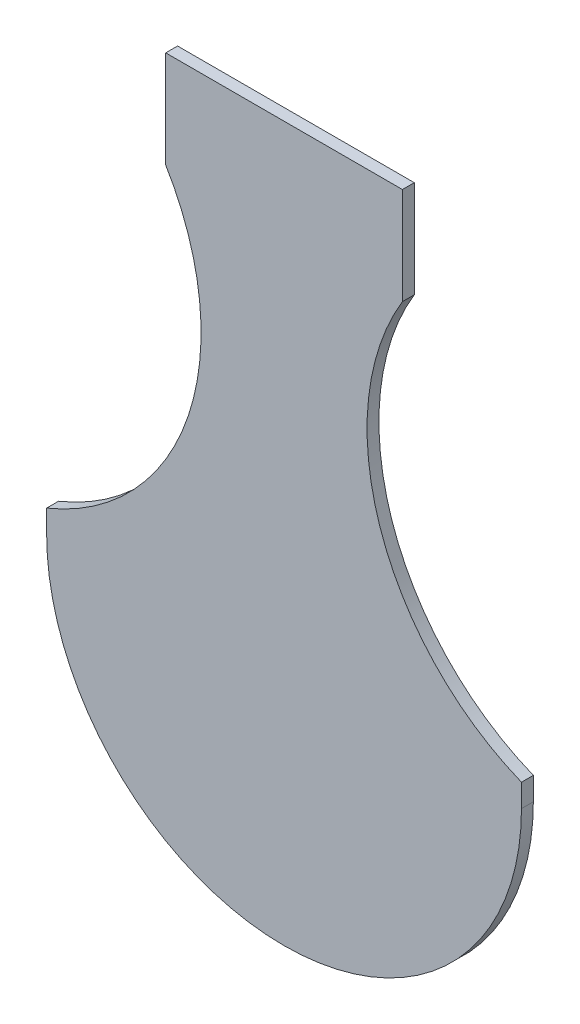
ISO-10303-21;
HEADER;
FILE_DESCRIPTION(('STEP AP214'),'2;1');
FILE_NAME('part.step','',(''),(''),'','','');
FILE_SCHEMA(('AUTOMOTIVE_DESIGN { 1 0 10303 214 1 1 1 1 }'));
ENDSEC;
DATA;
#1=APPLICATION_CONTEXT('core data for automotive mechanical design processes');
#2=APPLICATION_PROTOCOL_DEFINITION('international standard','automotive_design',2000,#1);
#3=PRODUCT_CONTEXT('',#1,'mechanical');
#4=PRODUCT('Part','Part','',(#3));
#5=PRODUCT_RELATED_PRODUCT_CATEGORY('part','',(#4));
#6=PRODUCT_DEFINITION_FORMATION('','',#4);
#7=PRODUCT_DEFINITION_CONTEXT('part definition',#1,'design');
#8=PRODUCT_DEFINITION('design','',#6,#7);
#9=PRODUCT_DEFINITION_SHAPE('','',#8);
#10=(LENGTH_UNIT() NAMED_UNIT(*) SI_UNIT(.MILLI.,.METRE.));
#11=(NAMED_UNIT(*) PLANE_ANGLE_UNIT() SI_UNIT($,.RADIAN.));
#12=(NAMED_UNIT(*) SI_UNIT($,.STERADIAN.) SOLID_ANGLE_UNIT());
#13=UNCERTAINTY_MEASURE_WITH_UNIT(LENGTH_MEASURE(1.E-05),#10,'distance_accuracy_value','');
#14=(GEOMETRIC_REPRESENTATION_CONTEXT(3) GLOBAL_UNCERTAINTY_ASSIGNED_CONTEXT((#13)) GLOBAL_UNIT_ASSIGNED_CONTEXT((#10,
#11,#12)) REPRESENTATION_CONTEXT('',''));
#15=CARTESIAN_POINT('',(0.,0.,0.));
#16=DIRECTION('',(0.,0.,1.));
#17=DIRECTION('',(1.,0.,0.));
#18=AXIS2_PLACEMENT_3D('',#15,#16,#17);
#19=CARTESIAN_POINT('',(-60.,65.7793965940956,3.));
#20=DIRECTION('',(1.,0.,0.));
#21=DIRECTION('',(0.,1.,0.));
#22=AXIS2_PLACEMENT_3D('',#19,#20,#21);
#23=PLANE('',#22);
#24=DIRECTION('',(0.,0.,1.));
#25=VECTOR('',#24,1.);
#26=CARTESIAN_POINT('',(-60.,60.,0.));
#27=LINE('',#26,#25);
#28=CARTESIAN_POINT('',(-60.,60.,0.));
#29=VERTEX_POINT('',#28);
#30=CARTESIAN_POINT('',(-60.,60.,3.));
#31=VERTEX_POINT('',#30);
#32=EDGE_CURVE('E163',#29,#31,#27,.T.);
#33=ORIENTED_EDGE('',*,*,#32,.T.);
#34=DIRECTION('',(0.,-1.,0.));
#35=VECTOR('',#34,1.);
#36=CARTESIAN_POINT('',(-60.,65.7793965940956,3.));
#37=LINE('',#36,#35);
#38=CARTESIAN_POINT('',(-60.,65.7793965940956,3.));
#39=VERTEX_POINT('',#38);
#40=EDGE_CURVE('E122',#39,#31,#37,.T.);
#41=ORIENTED_EDGE('',*,*,#40,.F.);
#42=DIRECTION('',(0.,0.,-1.));
#43=VECTOR('',#42,1.);
#44=CARTESIAN_POINT('',(-60.,65.7793965940956,3.));
#45=LINE('',#44,#43);
#46=CARTESIAN_POINT('',(-60.,65.7793965940956,0.));
#47=VERTEX_POINT('',#46);
#48=EDGE_CURVE('E118',#39,#47,#45,.T.);
#49=ORIENTED_EDGE('',*,*,#48,.T.);
#50=DIRECTION('',(0.,-1.,0.));
#51=VECTOR('',#50,1.);
#52=CARTESIAN_POINT('',(-60.,65.7793965940956,0.));
#53=LINE('',#52,#51);
#54=EDGE_CURVE('E139',#47,#29,#53,.T.);
#55=ORIENTED_EDGE('',*,*,#54,.T.);
#56=EDGE_LOOP('',(#33,#41,#49,#55));
#57=FACE_BOUND('',#56,.T.);
#58=ADVANCED_FACE('F33',(#57),#23,.F.);
#59=CARTESIAN_POINT('',(83.4736078855162,123.703827819936,3.));
#60=DIRECTION('',(0.,0.,-1.));
#61=DIRECTION('',(-1.,0.,0.));
#62=AXIS2_PLACEMENT_3D('',#59,#60,#61);
#63=CYLINDRICAL_SURFACE('',#62,62.5000000000003);
#64=CARTESIAN_POINT('',(83.4736078855162,123.703827819936,0.));
#65=DIRECTION('',(0.,0.,-1.));
#66=DIRECTION('',(-1.,0.,0.));
#67=AXIS2_PLACEMENT_3D('',#64,#65,#66);
#68=CIRCLE('',#67,62.5000000000003);
#69=CARTESIAN_POINT('',(60.,65.7793965940956,0.));
#70=VERTEX_POINT('',#69);
#71=CARTESIAN_POINT('',(29.909652168719,155.908682236142,0.));
#72=VERTEX_POINT('',#71);
#73=EDGE_CURVE('E129',#70,#72,#68,.T.);
#74=ORIENTED_EDGE('',*,*,#73,.T.);
#75=DIRECTION('',(0.,0.,-1.));
#76=VECTOR('',#75,1.);
#77=CARTESIAN_POINT('',(29.909652168719,155.908682236142,3.));
#78=LINE('',#77,#76);
#79=CARTESIAN_POINT('',(29.909652168719,155.908682236142,3.));
#80=VERTEX_POINT('',#79);
#81=EDGE_CURVE('E42',#80,#72,#78,.T.);
#82=ORIENTED_EDGE('',*,*,#81,.F.);
#83=CARTESIAN_POINT('',(83.4736078855162,123.703827819936,3.));
#84=DIRECTION('',(0.,0.,-1.));
#85=DIRECTION('',(-1.,0.,0.));
#86=AXIS2_PLACEMENT_3D('',#83,#84,#85);
#87=CIRCLE('',#86,62.5000000000003);
#88=CARTESIAN_POINT('',(60.,65.7793965940956,3.));
#89=VERTEX_POINT('',#88);
#90=EDGE_CURVE('E143',#89,#80,#87,.T.);
#91=ORIENTED_EDGE('',*,*,#90,.F.);
#92=DIRECTION('',(0.,0.,-1.));
#93=VECTOR('',#92,1.);
#94=CARTESIAN_POINT('',(60.,65.7793965940956,3.));
#95=LINE('',#94,#93);
#96=EDGE_CURVE('E128',#89,#70,#95,.T.);
#97=ORIENTED_EDGE('',*,*,#96,.T.);
#98=EDGE_LOOP('',(#74,#82,#91,#97));
#99=FACE_BOUND('',#98,.T.);
#100=ADVANCED_FACE('F35',(#99),#63,.F.);
#101=CARTESIAN_POINT('',(29.909652168719,155.908682236142,3.));
#102=DIRECTION('',(-1.,0.,0.));
#103=DIRECTION('',(0.,0.,1.));
#104=AXIS2_PLACEMENT_3D('',#101,#102,#103);
#105=PLANE('',#104);
#106=DIRECTION('',(0.,1.,0.));
#107=VECTOR('',#106,1.);
#108=CARTESIAN_POINT('',(29.909652168719,155.908682236142,0.));
#109=LINE('',#108,#107);
#110=CARTESIAN_POINT('',(29.909652168719,180.45552865264,0.));
#111=VERTEX_POINT('',#110);
#112=EDGE_CURVE('E132',#72,#111,#109,.T.);
#113=ORIENTED_EDGE('',*,*,#112,.T.);
#114=DIRECTION('',(0.,0.,-1.));
#115=VECTOR('',#114,1.);
#116=CARTESIAN_POINT('',(29.909652168719,180.45552865264,3.));
#117=LINE('',#116,#115);
#118=CARTESIAN_POINT('',(29.909652168719,180.45552865264,3.));
#119=VERTEX_POINT('',#118);
#120=EDGE_CURVE('E147',#119,#111,#117,.T.);
#121=ORIENTED_EDGE('',*,*,#120,.F.);
#122=DIRECTION('',(0.,1.,0.));
#123=VECTOR('',#122,1.);
#124=CARTESIAN_POINT('',(29.909652168719,155.908682236142,3.));
#125=LINE('',#124,#123);
#126=EDGE_CURVE('E91',#80,#119,#125,.T.);
#127=ORIENTED_EDGE('',*,*,#126,.F.);
#128=ORIENTED_EDGE('',*,*,#81,.T.);
#129=EDGE_LOOP('',(#113,#121,#127,#128));
#130=FACE_BOUND('',#129,.T.);
#131=ADVANCED_FACE('F150',(#130),#105,.F.);
#132=CARTESIAN_POINT('',(-29.909652168719,180.45552865264,3.));
#133=DIRECTION('',(0.,-1.,0.));
#134=DIRECTION('',(0.,0.,-1.));
#135=AXIS2_PLACEMENT_3D('',#132,#133,#134);
#136=PLANE('',#135);
#137=DIRECTION('',(-1.,0.,0.));
#138=VECTOR('',#137,1.);
#139=CARTESIAN_POINT('',(-29.909652168719,180.45552865264,0.));
#140=LINE('',#139,#138);
#141=CARTESIAN_POINT('',(-29.909652168719,180.45552865264,0.));
#142=VERTEX_POINT('',#141);
#143=EDGE_CURVE('E135',#111,#142,#140,.T.);
#144=ORIENTED_EDGE('',*,*,#143,.T.);
#145=DIRECTION('',(0.,0.,-1.));
#146=VECTOR('',#145,1.);
#147=CARTESIAN_POINT('',(-29.909652168719,180.45552865264,3.));
#148=LINE('',#147,#146);
#149=CARTESIAN_POINT('',(-29.909652168719,180.45552865264,3.));
#150=VERTEX_POINT('',#149);
#151=EDGE_CURVE('E117',#150,#142,#148,.T.);
#152=ORIENTED_EDGE('',*,*,#151,.F.);
#153=DIRECTION('',(-1.,0.,0.));
#154=VECTOR('',#153,1.);
#155=CARTESIAN_POINT('',(-29.909652168719,180.45552865264,3.));
#156=LINE('',#155,#154);
#157=EDGE_CURVE('E108',#119,#150,#156,.T.);
#158=ORIENTED_EDGE('',*,*,#157,.F.);
#159=ORIENTED_EDGE('',*,*,#120,.T.);
#160=EDGE_LOOP('',(#144,#152,#158,#159));
#161=FACE_BOUND('',#160,.T.);
#162=ADVANCED_FACE('F159',(#161),#136,.F.);
#163=CARTESIAN_POINT('',(-29.909652168719,155.908682236142,3.));
#164=DIRECTION('',(1.,0.,0.));
#165=DIRECTION('',(0.,0.,-1.));
#166=AXIS2_PLACEMENT_3D('',#163,#164,#165);
#167=PLANE('',#166);
#168=DIRECTION('',(0.,-1.,0.));
#169=VECTOR('',#168,1.);
#170=CARTESIAN_POINT('',(-29.909652168719,155.908682236142,0.));
#171=LINE('',#170,#169);
#172=CARTESIAN_POINT('',(-29.909652168719,155.908682236142,0.));
#173=VERTEX_POINT('',#172);
#174=EDGE_CURVE('E116',#142,#173,#171,.T.);
#175=ORIENTED_EDGE('',*,*,#174,.T.);
#176=DIRECTION('',(0.,0.,-1.));
#177=VECTOR('',#176,1.);
#178=CARTESIAN_POINT('',(-29.909652168719,155.908682236142,3.));
#179=LINE('',#178,#177);
#180=CARTESIAN_POINT('',(-29.909652168719,155.908682236142,3.));
#181=VERTEX_POINT('',#180);
#182=EDGE_CURVE('E113',#181,#173,#179,.T.);
#183=ORIENTED_EDGE('',*,*,#182,.F.);
#184=DIRECTION('',(0.,-1.,0.));
#185=VECTOR('',#184,1.);
#186=CARTESIAN_POINT('',(-29.909652168719,155.908682236142,3.));
#187=LINE('',#186,#185);
#188=EDGE_CURVE('E101',#150,#181,#187,.T.);
#189=ORIENTED_EDGE('',*,*,#188,.F.);
#190=ORIENTED_EDGE('',*,*,#151,.T.);
#191=EDGE_LOOP('',(#175,#183,#189,#190));
#192=FACE_BOUND('',#191,.T.);
#193=ADVANCED_FACE('F114',(#192),#167,.F.);
#194=CARTESIAN_POINT('',(-83.4736078855162,123.703827819936,3.));
#195=DIRECTION('',(0.,0.,-1.));
#196=DIRECTION('',(-1.,0.,0.));
#197=AXIS2_PLACEMENT_3D('',#194,#195,#196);
#198=CYLINDRICAL_SURFACE('',#197,62.5000000000003);
#199=CARTESIAN_POINT('',(-83.4736078855162,123.703827819936,0.));
#200=DIRECTION('',(0.,0.,-1.));
#201=DIRECTION('',(1.,0.,0.));
#202=AXIS2_PLACEMENT_3D('',#199,#200,#201);
#203=CIRCLE('',#202,62.5000000000003);
#204=EDGE_CURVE('E75',#173,#47,#203,.T.);
#205=ORIENTED_EDGE('',*,*,#204,.T.);
#206=ORIENTED_EDGE('',*,*,#48,.F.);
#207=CARTESIAN_POINT('',(-83.4736078855162,123.703827819936,3.));
#208=DIRECTION('',(0.,0.,-1.));
#209=DIRECTION('',(1.,0.,0.));
#210=AXIS2_PLACEMENT_3D('',#207,#208,#209);
#211=CIRCLE('',#210,62.5000000000003);
#212=EDGE_CURVE('E106',#181,#39,#211,.T.);
#213=ORIENTED_EDGE('',*,*,#212,.F.);
#214=ORIENTED_EDGE('',*,*,#182,.T.);
#215=EDGE_LOOP('',(#205,#206,#213,#214));
#216=FACE_BOUND('',#215,.T.);
#217=ADVANCED_FACE('F120',(#216),#198,.F.);
#218=CARTESIAN_POINT('',(60.,65.7793965940956,3.));
#219=DIRECTION('',(-1.,0.,0.));
#220=DIRECTION('',(0.,-1.,0.));
#221=AXIS2_PLACEMENT_3D('',#218,#219,#220);
#222=PLANE('',#221);
#223=DIRECTION('',(0.,1.,0.));
#224=VECTOR('',#223,1.);
#225=CARTESIAN_POINT('',(60.,65.7793965940956,3.));
#226=LINE('',#225,#224);
#227=CARTESIAN_POINT('',(60.,60.,3.));
#228=VERTEX_POINT('',#227);
#229=EDGE_CURVE('E50',#228,#89,#226,.T.);
#230=ORIENTED_EDGE('',*,*,#229,.F.);
#231=DIRECTION('',(0.,0.,1.));
#232=VECTOR('',#231,1.);
#233=CARTESIAN_POINT('',(60.,60.,0.));
#234=LINE('',#233,#232);
#235=CARTESIAN_POINT('',(60.,60.,0.));
#236=VERTEX_POINT('',#235);
#237=EDGE_CURVE('E133',#236,#228,#234,.T.);
#238=ORIENTED_EDGE('',*,*,#237,.F.);
#239=DIRECTION('',(0.,1.,0.));
#240=VECTOR('',#239,1.);
#241=CARTESIAN_POINT('',(60.,65.7793965940956,0.));
#242=LINE('',#241,#240);
#243=EDGE_CURVE('E82',#236,#70,#242,.T.);
#244=ORIENTED_EDGE('',*,*,#243,.T.);
#245=ORIENTED_EDGE('',*,*,#96,.F.);
#246=EDGE_LOOP('',(#230,#238,#244,#245));
#247=FACE_BOUND('',#246,.T.);
#248=ADVANCED_FACE('F179',(#247),#222,.F.);
#249=CARTESIAN_POINT('',(83.4736078855162,123.703827819936,3.));
#250=DIRECTION('',(0.,0.,-1.));
#251=DIRECTION('',(-1.,0.,0.));
#252=AXIS2_PLACEMENT_3D('',#249,#250,#251);
#253=PLANE('',#252);
#254=ORIENTED_EDGE('',*,*,#40,.T.);
#255=CARTESIAN_POINT('',(0.,60.,3.));
#256=DIRECTION('',(0.,0.,-1.));
#257=DIRECTION('',(-1.,0.,0.));
#258=AXIS2_PLACEMENT_3D('',#255,#256,#257);
#259=CIRCLE('',#258,60.);
#260=EDGE_CURVE('E166',#228,#31,#259,.T.);
#261=ORIENTED_EDGE('',*,*,#260,.F.);
#262=ORIENTED_EDGE('',*,*,#229,.T.);
#263=ORIENTED_EDGE('',*,*,#90,.T.);
#264=ORIENTED_EDGE('',*,*,#126,.T.);
#265=ORIENTED_EDGE('',*,*,#157,.T.);
#266=ORIENTED_EDGE('',*,*,#188,.T.);
#267=ORIENTED_EDGE('',*,*,#212,.T.);
#268=EDGE_LOOP('',(#254,#261,#262,#263,#264,#265,#266,#267));
#269=FACE_BOUND('',#268,.T.);
#270=ADVANCED_FACE('F104',(#269),#253,.F.);
#271=CARTESIAN_POINT('',(83.4736078855162,123.703827819936,0.));
#272=DIRECTION('',(0.,0.,-1.));
#273=DIRECTION('',(-1.,0.,0.));
#274=AXIS2_PLACEMENT_3D('',#271,#272,#273);
#275=PLANE('',#274);
#276=CARTESIAN_POINT('',(0.,60.,0.));
#277=DIRECTION('',(0.,0.,-1.));
#278=DIRECTION('',(-1.,0.,0.));
#279=AXIS2_PLACEMENT_3D('',#276,#277,#278);
#280=CIRCLE('',#279,60.);
#281=EDGE_CURVE('E11',#29,#236,#280,.F.);
#282=ORIENTED_EDGE('',*,*,#281,.F.);
#283=ORIENTED_EDGE('',*,*,#54,.F.);
#284=ORIENTED_EDGE('',*,*,#204,.F.);
#285=ORIENTED_EDGE('',*,*,#174,.F.);
#286=ORIENTED_EDGE('',*,*,#143,.F.);
#287=ORIENTED_EDGE('',*,*,#112,.F.);
#288=ORIENTED_EDGE('',*,*,#73,.F.);
#289=ORIENTED_EDGE('',*,*,#243,.F.);
#290=EDGE_LOOP('',(#282,#283,#284,#285,#286,#287,#288,#289));
#291=FACE_BOUND('',#290,.T.);
#292=ADVANCED_FACE('F156',(#291),#275,.T.);
#293=CARTESIAN_POINT('',(0.,60.,0.));
#294=DIRECTION('',(0.,0.,1.));
#295=DIRECTION('',(1.,0.,0.));
#296=AXIS2_PLACEMENT_3D('',#293,#294,#295);
#297=CYLINDRICAL_SURFACE('',#296,60.);
#298=ORIENTED_EDGE('',*,*,#260,.T.);
#299=ORIENTED_EDGE('',*,*,#32,.F.);
#300=ORIENTED_EDGE('',*,*,#281,.T.);
#301=ORIENTED_EDGE('',*,*,#237,.T.);
#302=EDGE_LOOP('',(#298,#299,#300,#301));
#303=FACE_BOUND('',#302,.T.);
#304=ADVANCED_FACE('F173',(#303),#297,.T.);
#305=CLOSED_SHELL('',(#58,#100,#131,#162,#193,#217,#248,#270,#292,#304));
#306=MANIFOLD_SOLID_BREP('B2',#305);
#307=ADVANCED_BREP_SHAPE_REPRESENTATION('',(#18,#306),#14);
#308=SHAPE_DEFINITION_REPRESENTATION(#9,#307);
ENDSEC;
END-ISO-10303-21;
